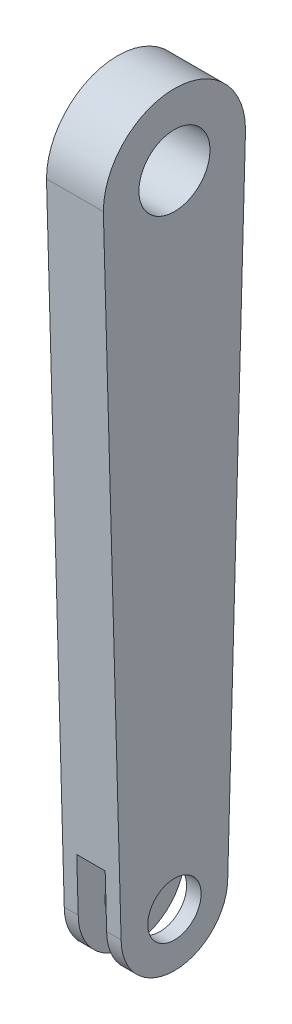
ISO-10303-21;
HEADER;
FILE_DESCRIPTION(('STEP AP214'),'2;1');
FILE_NAME('part.step','',(''),(''),'','','');
FILE_SCHEMA(('AUTOMOTIVE_DESIGN { 1 0 10303 214 1 1 1 1 }'));
ENDSEC;
DATA;
#1=APPLICATION_CONTEXT('core data for automotive mechanical design processes');
#2=APPLICATION_PROTOCOL_DEFINITION('international standard','automotive_design',2000,#1);
#3=PRODUCT_CONTEXT('',#1,'mechanical');
#4=PRODUCT('Part','Part','',(#3));
#5=PRODUCT_RELATED_PRODUCT_CATEGORY('part','',(#4));
#6=PRODUCT_DEFINITION_FORMATION('','',#4);
#7=PRODUCT_DEFINITION_CONTEXT('part definition',#1,'design');
#8=PRODUCT_DEFINITION('design','',#6,#7);
#9=PRODUCT_DEFINITION_SHAPE('','',#8);
#10=(LENGTH_UNIT() NAMED_UNIT(*) SI_UNIT(.MILLI.,.METRE.));
#11=(NAMED_UNIT(*) PLANE_ANGLE_UNIT() SI_UNIT($,.RADIAN.));
#12=(NAMED_UNIT(*) SI_UNIT($,.STERADIAN.) SOLID_ANGLE_UNIT());
#13=UNCERTAINTY_MEASURE_WITH_UNIT(LENGTH_MEASURE(1.E-05),#10,'distance_accuracy_value','');
#14=(GEOMETRIC_REPRESENTATION_CONTEXT(3) GLOBAL_UNCERTAINTY_ASSIGNED_CONTEXT((#13)) GLOBAL_UNIT_ASSIGNED_CONTEXT((#10,
#11,#12)) REPRESENTATION_CONTEXT('',''));
#15=CARTESIAN_POINT('',(0.,0.,0.));
#16=DIRECTION('',(0.,0.,1.));
#17=DIRECTION('',(1.,0.,0.));
#18=AXIS2_PLACEMENT_3D('',#15,#16,#17);
#19=CARTESIAN_POINT('',(16.,-180.,0.));
#20=DIRECTION('',(-1.,0.,0.));
#21=DIRECTION('',(0.,0.,1.));
#22=AXIS2_PLACEMENT_3D('',#19,#20,#21);
#23=CYLINDRICAL_SURFACE('',#22,15.);
#24=CARTESIAN_POINT('',(11.9274315221081,-180.,0.));
#25=DIRECTION('',(-1.,0.,0.));
#26=DIRECTION('',(0.,0.,1.));
#27=AXIS2_PLACEMENT_3D('',#24,#25,#26);
#28=CIRCLE('',#27,15.);
#29=CARTESIAN_POINT('',(11.9274315221081,-180.,-15.));
#30=VERTEX_POINT('',#29);
#31=CARTESIAN_POINT('',(11.9274315221081,-180.,15.));
#32=VERTEX_POINT('',#31);
#33=EDGE_CURVE('E140',#30,#32,#28,.T.);
#34=ORIENTED_EDGE('',*,*,#33,.F.);
#35=DIRECTION('',(-1.,0.,0.));
#36=VECTOR('',#35,1.);
#37=CARTESIAN_POINT('',(16.,-180.,-15.));
#38=LINE('',#37,#36);
#39=CARTESIAN_POINT('',(16.,-180.,-15.));
#40=VERTEX_POINT('',#39);
#41=EDGE_CURVE('E48',#40,#30,#38,.T.);
#42=ORIENTED_EDGE('',*,*,#41,.F.);
#43=CARTESIAN_POINT('',(16.,-180.,0.));
#44=DIRECTION('',(1.,0.,0.));
#45=DIRECTION('',(0.,0.,-1.));
#46=AXIS2_PLACEMENT_3D('',#43,#44,#45);
#47=CIRCLE('',#46,15.);
#48=CARTESIAN_POINT('',(16.,-180.,15.));
#49=VERTEX_POINT('',#48);
#50=EDGE_CURVE('E91',#49,#40,#47,.T.);
#51=ORIENTED_EDGE('',*,*,#50,.F.);
#52=DIRECTION('',(-1.,0.,0.));
#53=VECTOR('',#52,1.);
#54=CARTESIAN_POINT('',(16.,-180.,15.));
#55=LINE('',#54,#53);
#56=EDGE_CURVE('E168',#49,#32,#55,.T.);
#57=ORIENTED_EDGE('',*,*,#56,.T.);
#58=EDGE_LOOP('',(#34,#42,#51,#57));
#59=FACE_BOUND('',#58,.T.);
#60=ADVANCED_FACE('F41',(#59),#23,.T.);
#61=CARTESIAN_POINT('',(3.92743152210811,-180.,0.));
#62=DIRECTION('',(1.,0.,0.));
#63=DIRECTION('',(0.,0.,-1.));
#64=AXIS2_PLACEMENT_3D('',#61,#62,#63);
#65=CIRCLE('',#64,15.);
#66=CARTESIAN_POINT('',(3.92743152210811,-180.,15.));
#67=VERTEX_POINT('',#66);
#68=CARTESIAN_POINT('',(3.9274315221081,-180.,-15.));
#69=VERTEX_POINT('',#68);
#70=EDGE_CURVE('E121',#67,#69,#65,.T.);
#71=ORIENTED_EDGE('',*,*,#70,.F.);
#72=CARTESIAN_POINT('',(0.,-180.,15.));
#73=VERTEX_POINT('',#72);
#74=EDGE_CURVE('E86',#67,#73,#55,.T.);
#75=ORIENTED_EDGE('',*,*,#74,.T.);
#76=CARTESIAN_POINT('',(0.,-180.,0.));
#77=DIRECTION('',(1.,0.,0.));
#78=DIRECTION('',(0.,0.,-1.));
#79=AXIS2_PLACEMENT_3D('',#76,#77,#78);
#80=CIRCLE('',#79,15.);
#81=CARTESIAN_POINT('',(0.,-180.,-15.));
#82=VERTEX_POINT('',#81);
#83=EDGE_CURVE('E147',#73,#82,#80,.T.);
#84=ORIENTED_EDGE('',*,*,#83,.T.);
#85=EDGE_CURVE('E176',#69,#82,#38,.T.);
#86=ORIENTED_EDGE('',*,*,#85,.F.);
#87=EDGE_LOOP('',(#71,#75,#84,#86));
#88=FACE_BOUND('',#87,.T.);
#89=ADVANCED_FACE('F203',(#88),#23,.T.);
#90=CARTESIAN_POINT('',(16.,-0.555127216653819,-19.9845797995374));
#91=DIRECTION('',(0.,-0.0277670672403534,-0.999614420652718));
#92=DIRECTION('',(0.,0.999614420652718,-0.0277670672403534));
#93=AXIS2_PLACEMENT_3D('',#90,#91,#92);
#94=PLANE('',#93);
#95=ORIENTED_EDGE('',*,*,#41,.T.);
#96=DIRECTION('',(0.,0.999614420652718,-0.0277670672403534));
#97=VECTOR('',#96,1.);
#98=CARTESIAN_POINT('',(11.9274315221081,-0.555127216653819,-19.9845797995374));
#99=LINE('',#98,#97);
#100=CARTESIAN_POINT('',(11.9274315221081,-165.,-15.4166666666666));
#101=VERTEX_POINT('',#100);
#102=EDGE_CURVE('E134',#30,#101,#99,.T.);
#103=ORIENTED_EDGE('',*,*,#102,.T.);
#104=DIRECTION('',(1.,0.,0.));
#105=VECTOR('',#104,1.);
#106=CARTESIAN_POINT('',(16.,-165.,-15.4166666666666));
#107=LINE('',#106,#105);
#108=CARTESIAN_POINT('',(3.9274315221081,-165.,-15.4166666666666));
#109=VERTEX_POINT('',#108);
#110=EDGE_CURVE('E128',#109,#101,#107,.T.);
#111=ORIENTED_EDGE('',*,*,#110,.F.);
#112=DIRECTION('',(0.,-0.999614420652718,0.0277670672403534));
#113=VECTOR('',#112,1.);
#114=CARTESIAN_POINT('',(3.9274315221081,-0.555127216653819,-19.9845797995374));
#115=LINE('',#114,#113);
#116=EDGE_CURVE('E115',#109,#69,#115,.T.);
#117=ORIENTED_EDGE('',*,*,#116,.T.);
#118=ORIENTED_EDGE('',*,*,#85,.T.);
#119=DIRECTION('',(0.,-0.999614420652718,0.0277670672403534));
#120=VECTOR('',#119,1.);
#121=CARTESIAN_POINT('',(0.,-0.555127216653819,-19.9845797995374));
#122=LINE('',#121,#120);
#123=CARTESIAN_POINT('',(0.,0.,-20.));
#124=VERTEX_POINT('',#123);
#125=EDGE_CURVE('E162',#124,#82,#122,.T.);
#126=ORIENTED_EDGE('',*,*,#125,.F.);
#127=DIRECTION('',(-1.,0.,0.));
#128=VECTOR('',#127,1.);
#129=CARTESIAN_POINT('',(16.,0.,-20.));
#130=LINE('',#129,#128);
#131=CARTESIAN_POINT('',(16.,0.,-20.));
#132=VERTEX_POINT('',#131);
#133=EDGE_CURVE('E174',#132,#124,#130,.T.);
#134=ORIENTED_EDGE('',*,*,#133,.F.);
#135=DIRECTION('',(0.,-0.999614420652718,0.0277670672403534));
#136=VECTOR('',#135,1.);
#137=CARTESIAN_POINT('',(16.,-0.555127216653819,-19.9845797995374));
#138=LINE('',#137,#136);
#139=EDGE_CURVE('E154',#132,#40,#138,.T.);
#140=ORIENTED_EDGE('',*,*,#139,.T.);
#141=EDGE_LOOP('',(#95,#103,#111,#117,#118,#126,#134,#140));
#142=FACE_BOUND('',#141,.T.);
#143=ADVANCED_FACE('F133',(#142),#94,.T.);
#144=CARTESIAN_POINT('',(16.,-0.555127216653819,19.9845797995374));
#145=DIRECTION('',(0.,0.0277670672403534,-0.999614420652718));
#146=DIRECTION('',(0.,0.999614420652718,0.0277670672403534));
#147=AXIS2_PLACEMENT_3D('',#144,#145,#146);
#148=PLANE('',#147);
#149=DIRECTION('',(0.,0.999614420652718,0.0277670672403534));
#150=VECTOR('',#149,1.);
#151=CARTESIAN_POINT('',(11.9274315221081,-0.555127216653819,19.9845797995374));
#152=LINE('',#151,#150);
#153=CARTESIAN_POINT('',(11.9274315221081,-165.,15.4166666666666));
#154=VERTEX_POINT('',#153);
#155=EDGE_CURVE('E181',#32,#154,#152,.T.);
#156=ORIENTED_EDGE('',*,*,#155,.F.);
#157=ORIENTED_EDGE('',*,*,#56,.F.);
#158=DIRECTION('',(0.,-0.999614420652718,-0.0277670672403534));
#159=VECTOR('',#158,1.);
#160=CARTESIAN_POINT('',(16.,-0.555127216653819,19.9845797995374));
#161=LINE('',#160,#159);
#162=CARTESIAN_POINT('',(16.,0.,20.));
#163=VERTEX_POINT('',#162);
#164=EDGE_CURVE('E64',#163,#49,#161,.T.);
#165=ORIENTED_EDGE('',*,*,#164,.F.);
#166=DIRECTION('',(-1.,0.,0.));
#167=VECTOR('',#166,1.);
#168=CARTESIAN_POINT('',(16.,0.,20.));
#169=LINE('',#168,#167);
#170=CARTESIAN_POINT('',(0.,0.,20.));
#171=VERTEX_POINT('',#170);
#172=EDGE_CURVE('E171',#163,#171,#169,.T.);
#173=ORIENTED_EDGE('',*,*,#172,.T.);
#174=DIRECTION('',(0.,-0.999614420652718,-0.0277670672403534));
#175=VECTOR('',#174,1.);
#176=CARTESIAN_POINT('',(0.,-0.555127216653819,19.9845797995374));
#177=LINE('',#176,#175);
#178=EDGE_CURVE('E155',#171,#73,#177,.T.);
#179=ORIENTED_EDGE('',*,*,#178,.T.);
#180=ORIENTED_EDGE('',*,*,#74,.F.);
#181=DIRECTION('',(0.,-0.999614420652718,-0.0277670672403534));
#182=VECTOR('',#181,1.);
#183=CARTESIAN_POINT('',(3.92743152210811,-0.555127216653819,19.9845797995374));
#184=LINE('',#183,#182);
#185=CARTESIAN_POINT('',(3.92743152210811,-165.,15.4166666666666));
#186=VERTEX_POINT('',#185);
#187=EDGE_CURVE('E179',#186,#67,#184,.T.);
#188=ORIENTED_EDGE('',*,*,#187,.F.);
#189=DIRECTION('',(1.,0.,0.));
#190=VECTOR('',#189,1.);
#191=CARTESIAN_POINT('',(16.,-165.,15.4166666666666));
#192=LINE('',#191,#190);
#193=EDGE_CURVE('E11',#186,#154,#192,.T.);
#194=ORIENTED_EDGE('',*,*,#193,.T.);
#195=EDGE_LOOP('',(#156,#157,#165,#173,#179,#180,#188,#194));
#196=FACE_BOUND('',#195,.T.);
#197=ADVANCED_FACE('F202',(#196),#148,.F.);
#198=CARTESIAN_POINT('',(0.,-180.,0.));
#199=DIRECTION('',(1.,0.,0.));
#200=DIRECTION('',(0.,0.,-1.));
#201=AXIS2_PLACEMENT_3D('',#198,#199,#200);
#202=CYLINDRICAL_SURFACE('',#201,7.50000000000001);
#203=CARTESIAN_POINT('',(16.,-180.,0.));
#204=DIRECTION('',(1.,0.,0.));
#205=DIRECTION('',(0.,0.,-1.));
#206=AXIS2_PLACEMENT_3D('',#203,#204,#205);
#207=CIRCLE('',#206,7.50000000000001);
#208=CARTESIAN_POINT('',(16.,-180.,-7.50000000000003));
#209=VERTEX_POINT('',#208);
#210=EDGE_CURVE('E135',#209,#209,#207,.T.);
#211=ORIENTED_EDGE('',*,*,#210,.T.);
#212=EDGE_LOOP('',(#211));
#213=FACE_BOUND('',#212,.T.);
#214=CARTESIAN_POINT('',(11.9274315221081,-180.,0.));
#215=DIRECTION('',(-1.,0.,0.));
#216=DIRECTION('',(0.,0.,1.));
#217=AXIS2_PLACEMENT_3D('',#214,#215,#216);
#218=CIRCLE('',#217,7.50000000000001);
#219=CARTESIAN_POINT('',(11.9274315221081,-180.,7.49999999999998));
#220=VERTEX_POINT('',#219);
#221=EDGE_CURVE('E125',#220,#220,#218,.F.);
#222=ORIENTED_EDGE('',*,*,#221,.F.);
#223=EDGE_LOOP('',(#222));
#224=FACE_BOUND('',#223,.T.);
#225=ADVANCED_FACE('F231',(#213,#224),#202,.F.);
#226=CARTESIAN_POINT('',(0.,-180.,0.));
#227=DIRECTION('',(1.,0.,0.));
#228=DIRECTION('',(0.,0.,-1.));
#229=AXIS2_PLACEMENT_3D('',#226,#227,#228);
#230=CIRCLE('',#229,7.50000000000001);
#231=CARTESIAN_POINT('',(0.,-180.,-7.50000000000003));
#232=VERTEX_POINT('',#231);
#233=EDGE_CURVE('E138',#232,#232,#230,.T.);
#234=ORIENTED_EDGE('',*,*,#233,.F.);
#235=EDGE_LOOP('',(#234));
#236=FACE_BOUND('',#235,.T.);
#237=CARTESIAN_POINT('',(3.92743152210811,-180.,0.));
#238=DIRECTION('',(1.,0.,0.));
#239=DIRECTION('',(0.,0.,-1.));
#240=AXIS2_PLACEMENT_3D('',#237,#238,#239);
#241=CIRCLE('',#240,7.50000000000001);
#242=CARTESIAN_POINT('',(3.92743152210811,-180.,-7.50000000000003));
#243=VERTEX_POINT('',#242);
#244=EDGE_CURVE('E129',#243,#243,#241,.F.);
#245=ORIENTED_EDGE('',*,*,#244,.F.);
#246=EDGE_LOOP('',(#245));
#247=FACE_BOUND('',#246,.T.);
#248=ADVANCED_FACE('F234',(#236,#247),#202,.F.);
#249=CARTESIAN_POINT('',(16.,0.,0.));
#250=DIRECTION('',(-1.,0.,0.));
#251=DIRECTION('',(0.,0.,1.));
#252=AXIS2_PLACEMENT_3D('',#249,#250,#251);
#253=CYLINDRICAL_SURFACE('',#252,20.);
#254=CARTESIAN_POINT('',(0.,0.,0.));
#255=DIRECTION('',(1.,0.,0.));
#256=DIRECTION('',(0.,0.,-1.));
#257=AXIS2_PLACEMENT_3D('',#254,#255,#256);
#258=CIRCLE('',#257,20.);
#259=EDGE_CURVE('E165',#124,#171,#258,.T.);
#260=ORIENTED_EDGE('',*,*,#259,.T.);
#261=ORIENTED_EDGE('',*,*,#172,.F.);
#262=CARTESIAN_POINT('',(16.,0.,0.));
#263=DIRECTION('',(1.,0.,0.));
#264=DIRECTION('',(0.,0.,-1.));
#265=AXIS2_PLACEMENT_3D('',#262,#263,#264);
#266=CIRCLE('',#265,20.);
#267=EDGE_CURVE('E158',#132,#163,#266,.T.);
#268=ORIENTED_EDGE('',*,*,#267,.F.);
#269=ORIENTED_EDGE('',*,*,#133,.T.);
#270=EDGE_LOOP('',(#260,#261,#268,#269));
#271=FACE_BOUND('',#270,.T.);
#272=ADVANCED_FACE('F198',(#271),#253,.T.);
#273=CARTESIAN_POINT('',(16.,0.,0.));
#274=DIRECTION('',(1.,0.,0.));
#275=DIRECTION('',(0.,0.,-1.));
#276=AXIS2_PLACEMENT_3D('',#273,#274,#275);
#277=PLANE('',#276);
#278=CARTESIAN_POINT('',(16.,0.,0.));
#279=DIRECTION('',(1.,0.,0.));
#280=DIRECTION('',(0.,0.,-1.));
#281=AXIS2_PLACEMENT_3D('',#278,#279,#280);
#282=CIRCLE('',#281,10.);
#283=CARTESIAN_POINT('',(16.,0.,-10.));
#284=VERTEX_POINT('',#283);
#285=EDGE_CURVE('E148',#284,#284,#282,.T.);
#286=ORIENTED_EDGE('',*,*,#285,.F.);
#287=EDGE_LOOP('',(#286));
#288=FACE_BOUND('',#287,.T.);
#289=ORIENTED_EDGE('',*,*,#210,.F.);
#290=EDGE_LOOP('',(#289));
#291=FACE_BOUND('',#290,.T.);
#292=ORIENTED_EDGE('',*,*,#50,.T.);
#293=ORIENTED_EDGE('',*,*,#139,.F.);
#294=ORIENTED_EDGE('',*,*,#267,.T.);
#295=ORIENTED_EDGE('',*,*,#164,.T.);
#296=EDGE_LOOP('',(#292,#293,#294,#295));
#297=FACE_BOUND('',#296,.T.);
#298=ADVANCED_FACE('F195',(#288,#291,#297),#277,.T.);
#299=CARTESIAN_POINT('',(0.,0.,0.));
#300=DIRECTION('',(1.,0.,0.));
#301=DIRECTION('',(0.,0.,-1.));
#302=AXIS2_PLACEMENT_3D('',#299,#300,#301);
#303=PLANE('',#302);
#304=CARTESIAN_POINT('',(0.,0.,0.));
#305=DIRECTION('',(1.,0.,0.));
#306=DIRECTION('',(0.,0.,-1.));
#307=AXIS2_PLACEMENT_3D('',#304,#305,#306);
#308=CIRCLE('',#307,10.);
#309=CARTESIAN_POINT('',(0.,0.,-10.));
#310=VERTEX_POINT('',#309);
#311=EDGE_CURVE('E144',#310,#310,#308,.T.);
#312=ORIENTED_EDGE('',*,*,#311,.T.);
#313=EDGE_LOOP('',(#312));
#314=FACE_BOUND('',#313,.T.);
#315=ORIENTED_EDGE('',*,*,#233,.T.);
#316=EDGE_LOOP('',(#315));
#317=FACE_BOUND('',#316,.T.);
#318=ORIENTED_EDGE('',*,*,#83,.F.);
#319=ORIENTED_EDGE('',*,*,#178,.F.);
#320=ORIENTED_EDGE('',*,*,#259,.F.);
#321=ORIENTED_EDGE('',*,*,#125,.T.);
#322=EDGE_LOOP('',(#318,#319,#320,#321));
#323=FACE_BOUND('',#322,.T.);
#324=ADVANCED_FACE('F206',(#314,#317,#323),#303,.F.);
#325=CARTESIAN_POINT('',(0.,0.,0.));
#326=DIRECTION('',(1.,0.,0.));
#327=DIRECTION('',(0.,0.,-1.));
#328=AXIS2_PLACEMENT_3D('',#325,#326,#327);
#329=CYLINDRICAL_SURFACE('',#328,10.);
#330=ORIENTED_EDGE('',*,*,#311,.F.);
#331=EDGE_LOOP('',(#330));
#332=FACE_BOUND('',#331,.T.);
#333=ORIENTED_EDGE('',*,*,#285,.T.);
#334=EDGE_LOOP('',(#333));
#335=FACE_BOUND('',#334,.T.);
#336=ADVANCED_FACE('F208',(#332,#335),#329,.F.);
#337=CARTESIAN_POINT('',(0.,-165.,0.));
#338=DIRECTION('',(0.,1.,0.));
#339=DIRECTION('',(0.,0.,1.));
#340=AXIS2_PLACEMENT_3D('',#337,#338,#339);
#341=PLANE('',#340);
#342=ORIENTED_EDGE('',*,*,#110,.T.);
#343=DIRECTION('',(0.,0.,-1.));
#344=VECTOR('',#343,1.);
#345=CARTESIAN_POINT('',(11.9274315221081,-165.,-20.));
#346=LINE('',#345,#344);
#347=EDGE_CURVE('E55',#154,#101,#346,.T.);
#348=ORIENTED_EDGE('',*,*,#347,.F.);
#349=ORIENTED_EDGE('',*,*,#193,.F.);
#350=DIRECTION('',(0.,0.,1.));
#351=VECTOR('',#350,1.);
#352=CARTESIAN_POINT('',(3.9274315221081,-165.,-20.));
#353=LINE('',#352,#351);
#354=EDGE_CURVE('E119',#109,#186,#353,.T.);
#355=ORIENTED_EDGE('',*,*,#354,.F.);
#356=EDGE_LOOP('',(#342,#348,#349,#355));
#357=FACE_BOUND('',#356,.T.);
#358=ADVANCED_FACE('F127',(#357),#341,.F.);
#359=CARTESIAN_POINT('',(11.9274315221081,-165.,-20.));
#360=DIRECTION('',(-1.,0.,0.));
#361=DIRECTION('',(0.,0.,1.));
#362=AXIS2_PLACEMENT_3D('',#359,#360,#361);
#363=PLANE('',#362);
#364=ORIENTED_EDGE('',*,*,#33,.T.);
#365=ORIENTED_EDGE('',*,*,#155,.T.);
#366=ORIENTED_EDGE('',*,*,#347,.T.);
#367=ORIENTED_EDGE('',*,*,#102,.F.);
#368=EDGE_LOOP('',(#364,#365,#366,#367));
#369=FACE_BOUND('',#368,.T.);
#370=ORIENTED_EDGE('',*,*,#221,.T.);
#371=EDGE_LOOP('',(#370));
#372=FACE_BOUND('',#371,.T.);
#373=ADVANCED_FACE('F190',(#369,#372),#363,.T.);
#374=CARTESIAN_POINT('',(3.9274315221081,-165.,-20.));
#375=DIRECTION('',(1.,0.,0.));
#376=DIRECTION('',(0.,0.,-1.));
#377=AXIS2_PLACEMENT_3D('',#374,#375,#376);
#378=PLANE('',#377);
#379=ORIENTED_EDGE('',*,*,#354,.T.);
#380=ORIENTED_EDGE('',*,*,#187,.T.);
#381=ORIENTED_EDGE('',*,*,#70,.T.);
#382=ORIENTED_EDGE('',*,*,#116,.F.);
#383=EDGE_LOOP('',(#379,#380,#381,#382));
#384=FACE_BOUND('',#383,.T.);
#385=ORIENTED_EDGE('',*,*,#244,.T.);
#386=EDGE_LOOP('',(#385));
#387=FACE_BOUND('',#386,.T.);
#388=ADVANCED_FACE('F117',(#384,#387),#378,.T.);
#389=CLOSED_SHELL('',(#60,#89,#143,#197,#225,#248,#272,#298,#324,#336,#358,#373,#388));
#390=MANIFOLD_SOLID_BREP('B2',#389);
#391=ADVANCED_BREP_SHAPE_REPRESENTATION('',(#18,#390),#14);
#392=SHAPE_DEFINITION_REPRESENTATION(#9,#391);
ENDSEC;
END-ISO-10303-21;
